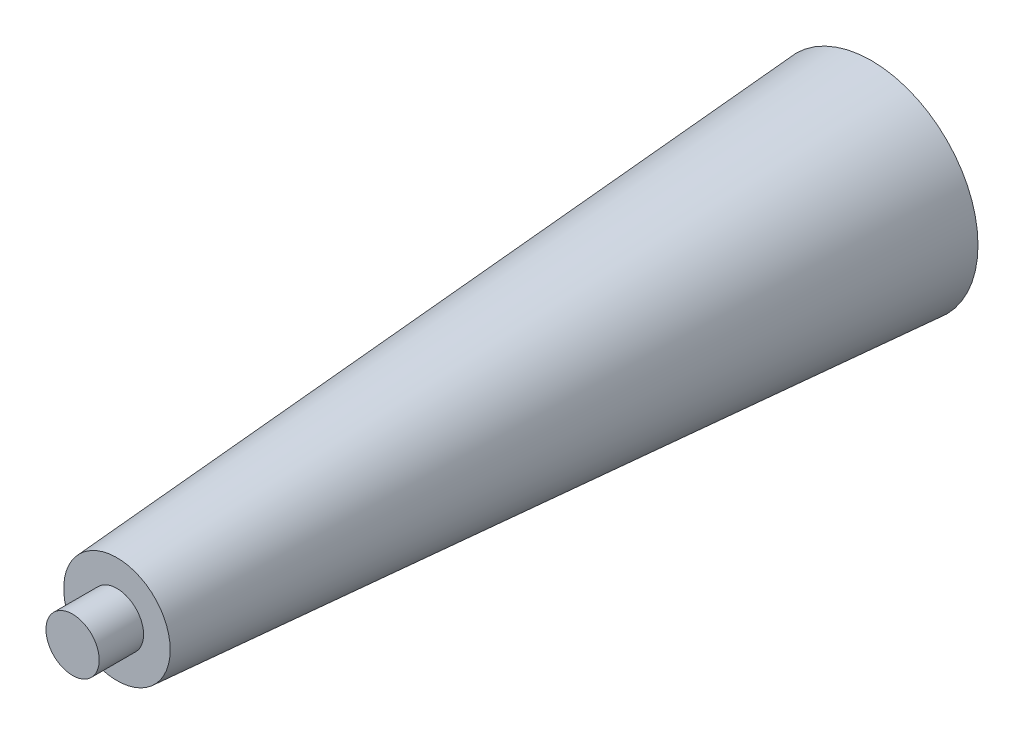
ISO-10303-21;
HEADER;
FILE_DESCRIPTION(('STEP AP214'),'2;1');
FILE_NAME('part.step','',(''),(''),'','','');
FILE_SCHEMA(('AUTOMOTIVE_DESIGN { 1 0 10303 214 1 1 1 1 }'));
ENDSEC;
DATA;
#1=APPLICATION_CONTEXT('core data for automotive mechanical design processes');
#2=APPLICATION_PROTOCOL_DEFINITION('international standard','automotive_design',2000,#1);
#3=PRODUCT_CONTEXT('',#1,'mechanical');
#4=PRODUCT('Part','Part','',(#3));
#5=PRODUCT_RELATED_PRODUCT_CATEGORY('part','',(#4));
#6=PRODUCT_DEFINITION_FORMATION('','',#4);
#7=PRODUCT_DEFINITION_CONTEXT('part definition',#1,'design');
#8=PRODUCT_DEFINITION('design','',#6,#7);
#9=PRODUCT_DEFINITION_SHAPE('','',#8);
#10=(LENGTH_UNIT() NAMED_UNIT(*) SI_UNIT(.MILLI.,.METRE.));
#11=(NAMED_UNIT(*) PLANE_ANGLE_UNIT() SI_UNIT($,.RADIAN.));
#12=(NAMED_UNIT(*) SI_UNIT($,.STERADIAN.) SOLID_ANGLE_UNIT());
#13=UNCERTAINTY_MEASURE_WITH_UNIT(LENGTH_MEASURE(1.E-05),#10,'distance_accuracy_value','');
#14=(GEOMETRIC_REPRESENTATION_CONTEXT(3) GLOBAL_UNCERTAINTY_ASSIGNED_CONTEXT((#13)) GLOBAL_UNIT_ASSIGNED_CONTEXT((#10,
#11,#12)) REPRESENTATION_CONTEXT('',''));
#15=CARTESIAN_POINT('',(0.,0.,0.));
#16=DIRECTION('',(0.,0.,1.));
#17=DIRECTION('',(1.,0.,0.));
#18=AXIS2_PLACEMENT_3D('',#15,#16,#17);
#19=CARTESIAN_POINT('',(0.,0.,0.));
#20=DIRECTION('',(0.,0.,-1.));
#21=DIRECTION('',(-1.,0.,0.));
#22=AXIS2_PLACEMENT_3D('',#19,#20,#21);
#23=PLANE('',#22);
#24=CARTESIAN_POINT('',(0.,0.,0.));
#25=DIRECTION('',(0.,0.,1.));
#26=DIRECTION('',(1.,0.,0.));
#27=AXIS2_PLACEMENT_3D('',#24,#25,#26);
#28=CIRCLE('',#27,12.);
#29=CARTESIAN_POINT('',(12.,0.,0.));
#30=VERTEX_POINT('',#29);
#31=EDGE_CURVE('E37',#30,#30,#28,.T.);
#32=ORIENTED_EDGE('',*,*,#31,.F.);
#33=EDGE_LOOP('',(#32));
#34=FACE_BOUND('',#33,.T.);
#35=ADVANCED_FACE('F34',(#34),#23,.T.);
#36=CARTESIAN_POINT('',(0.,0.,85.));
#37=DIRECTION('',(0.,0.,-1.));
#38=DIRECTION('',(-1.,0.,0.));
#39=AXIS2_PLACEMENT_3D('',#36,#37,#38);
#40=CONICAL_SURFACE('',#39,6.,0.0704713445787956);
#41=ORIENTED_EDGE('',*,*,#31,.T.);
#42=EDGE_LOOP('',(#41));
#43=FACE_BOUND('',#42,.T.);
#44=CARTESIAN_POINT('',(0.,0.,85.));
#45=DIRECTION('',(0.,0.,1.));
#46=DIRECTION('',(1.,0.,0.));
#47=AXIS2_PLACEMENT_3D('',#44,#45,#46);
#48=CIRCLE('',#47,6.);
#49=CARTESIAN_POINT('',(6.,0.,85.));
#50=VERTEX_POINT('',#49);
#51=EDGE_CURVE('E45',#50,#50,#48,.T.);
#52=ORIENTED_EDGE('',*,*,#51,.F.);
#53=EDGE_LOOP('',(#52));
#54=FACE_BOUND('',#53,.T.);
#55=ADVANCED_FACE('F65',(#43,#54),#40,.T.);
#56=CARTESIAN_POINT('',(0.,0.,85.));
#57=DIRECTION('',(0.,0.,1.));
#58=DIRECTION('',(1.,0.,0.));
#59=AXIS2_PLACEMENT_3D('',#56,#57,#58);
#60=PLANE('',#59);
#61=CARTESIAN_POINT('',(0.,0.,85.));
#62=DIRECTION('',(0.,0.,1.));
#63=DIRECTION('',(1.,0.,0.));
#64=AXIS2_PLACEMENT_3D('',#61,#62,#63);
#65=CIRCLE('',#64,3.);
#66=CARTESIAN_POINT('',(3.,0.,85.));
#67=VERTEX_POINT('',#66);
#68=EDGE_CURVE('E10',#67,#67,#65,.T.);
#69=ORIENTED_EDGE('',*,*,#68,.F.);
#70=EDGE_LOOP('',(#69));
#71=FACE_BOUND('',#70,.T.);
#72=ORIENTED_EDGE('',*,*,#51,.T.);
#73=EDGE_LOOP('',(#72));
#74=FACE_BOUND('',#73,.T.);
#75=ADVANCED_FACE('F58',(#71,#74),#60,.T.);
#76=CARTESIAN_POINT('',(0.,0.,90.));
#77=DIRECTION('',(0.,0.,-1.));
#78=DIRECTION('',(-1.,0.,0.));
#79=AXIS2_PLACEMENT_3D('',#76,#77,#78);
#80=CYLINDRICAL_SURFACE('',#79,3.);
#81=CARTESIAN_POINT('',(0.,0.,90.));
#82=DIRECTION('',(0.,0.,1.));
#83=DIRECTION('',(1.,0.,0.));
#84=AXIS2_PLACEMENT_3D('',#81,#82,#83);
#85=CIRCLE('',#84,3.);
#86=CARTESIAN_POINT('',(3.,0.,90.));
#87=VERTEX_POINT('',#86);
#88=EDGE_CURVE('E47',#87,#87,#85,.T.);
#89=ORIENTED_EDGE('',*,*,#88,.F.);
#90=EDGE_LOOP('',(#89));
#91=FACE_BOUND('',#90,.T.);
#92=ORIENTED_EDGE('',*,*,#68,.T.);
#93=EDGE_LOOP('',(#92));
#94=FACE_BOUND('',#93,.T.);
#95=ADVANCED_FACE('F56',(#91,#94),#80,.T.);
#96=CARTESIAN_POINT('',(0.,0.,90.));
#97=DIRECTION('',(0.,0.,1.));
#98=DIRECTION('',(1.,0.,0.));
#99=AXIS2_PLACEMENT_3D('',#96,#97,#98);
#100=PLANE('',#99);
#101=ORIENTED_EDGE('',*,*,#88,.T.);
#102=EDGE_LOOP('',(#101));
#103=FACE_BOUND('',#102,.T.);
#104=ADVANCED_FACE('F54',(#103),#100,.T.);
#105=CLOSED_SHELL('',(#35,#55,#75,#95,#104));
#106=MANIFOLD_SOLID_BREP('B2',#105);
#107=ADVANCED_BREP_SHAPE_REPRESENTATION('',(#18,#106),#14);
#108=SHAPE_DEFINITION_REPRESENTATION(#9,#107);
ENDSEC;
END-ISO-10303-21;
